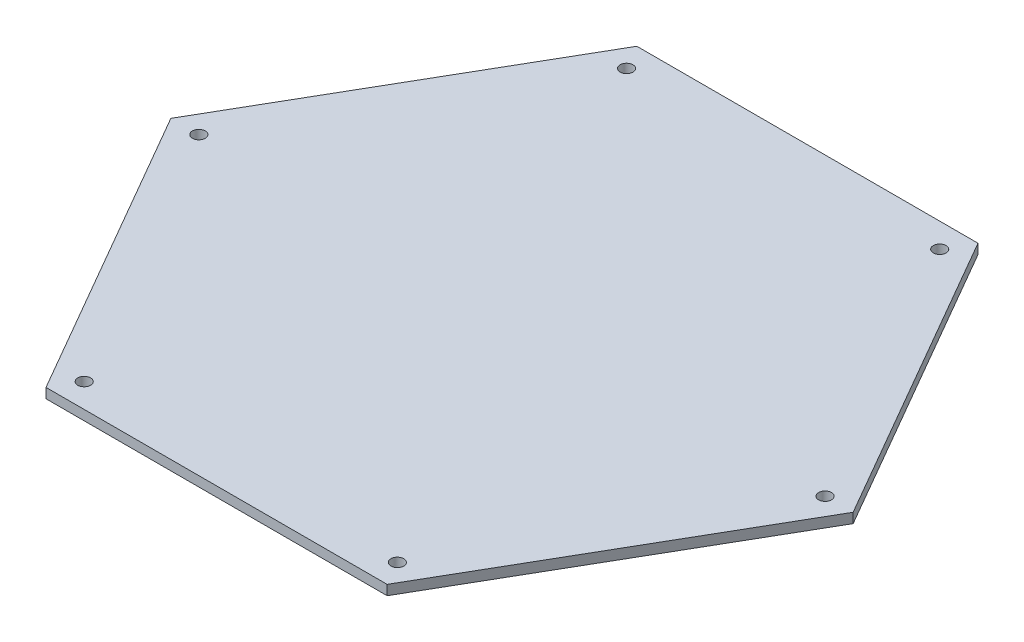
ISO-10303-21;
HEADER;
FILE_DESCRIPTION(('STEP AP214'),'2;1');
FILE_NAME('part.step','',(''),(''),'','','');
FILE_SCHEMA(('AUTOMOTIVE_DESIGN { 1 0 10303 214 1 1 1 1 }'));
ENDSEC;
DATA;
#1=APPLICATION_CONTEXT('core data for automotive mechanical design processes');
#2=APPLICATION_PROTOCOL_DEFINITION('international standard','automotive_design',2000,#1);
#3=PRODUCT_CONTEXT('',#1,'mechanical');
#4=PRODUCT('Part','Part','',(#3));
#5=PRODUCT_RELATED_PRODUCT_CATEGORY('part','',(#4));
#6=PRODUCT_DEFINITION_FORMATION('','',#4);
#7=PRODUCT_DEFINITION_CONTEXT('part definition',#1,'design');
#8=PRODUCT_DEFINITION('design','',#6,#7);
#9=PRODUCT_DEFINITION_SHAPE('','',#8);
#10=(LENGTH_UNIT() NAMED_UNIT(*) SI_UNIT(.MILLI.,.METRE.));
#11=(NAMED_UNIT(*) PLANE_ANGLE_UNIT() SI_UNIT($,.RADIAN.));
#12=(NAMED_UNIT(*) SI_UNIT($,.STERADIAN.) SOLID_ANGLE_UNIT());
#13=UNCERTAINTY_MEASURE_WITH_UNIT(LENGTH_MEASURE(1.E-05),#10,'distance_accuracy_value','');
#14=(GEOMETRIC_REPRESENTATION_CONTEXT(3) GLOBAL_UNCERTAINTY_ASSIGNED_CONTEXT((#13)) GLOBAL_UNIT_ASSIGNED_CONTEXT((#10,
#11,#12)) REPRESENTATION_CONTEXT('',''));
#15=CARTESIAN_POINT('',(0.,0.,0.));
#16=DIRECTION('',(0.,0.,1.));
#17=DIRECTION('',(1.,0.,0.));
#18=AXIS2_PLACEMENT_3D('',#15,#16,#17);
#19=CARTESIAN_POINT('',(-43.8841052859688,2.54,76.0095));
#20=DIRECTION('',(0.,0.,-1.));
#21=DIRECTION('',(-1.,0.,0.));
#22=AXIS2_PLACEMENT_3D('',#19,#20,#21);
#23=PLANE('',#22);
#24=DIRECTION('',(1.,0.,0.));
#25=VECTOR('',#24,1.);
#26=CARTESIAN_POINT('',(-43.8841052859688,0.,76.0095));
#27=LINE('',#26,#25);
#28=CARTESIAN_POINT('',(-43.8841052859688,0.,76.0095));
#29=VERTEX_POINT('',#28);
#30=CARTESIAN_POINT('',(43.8841052859688,0.,76.0095));
#31=VERTEX_POINT('',#30);
#32=EDGE_CURVE('E121',#29,#31,#27,.T.);
#33=ORIENTED_EDGE('',*,*,#32,.T.);
#34=DIRECTION('',(0.,-1.,0.));
#35=VECTOR('',#34,1.);
#36=CARTESIAN_POINT('',(43.8841052859688,2.54,76.0095));
#37=LINE('',#36,#35);
#38=CARTESIAN_POINT('',(43.8841052859688,2.54,76.0095));
#39=VERTEX_POINT('',#38);
#40=EDGE_CURVE('E11',#39,#31,#37,.T.);
#41=ORIENTED_EDGE('',*,*,#40,.F.);
#42=DIRECTION('',(1.,0.,0.));
#43=VECTOR('',#42,1.);
#44=CARTESIAN_POINT('',(-43.8841052859688,2.54,76.0095));
#45=LINE('',#44,#43);
#46=CARTESIAN_POINT('',(-43.8841052859688,2.54,76.0095));
#47=VERTEX_POINT('',#46);
#48=EDGE_CURVE('E132',#47,#39,#45,.T.);
#49=ORIENTED_EDGE('',*,*,#48,.F.);
#50=DIRECTION('',(0.,-1.,0.));
#51=VECTOR('',#50,1.);
#52=CARTESIAN_POINT('',(-43.8841052859688,2.54,76.0095));
#53=LINE('',#52,#51);
#54=EDGE_CURVE('E117',#47,#29,#53,.T.);
#55=ORIENTED_EDGE('',*,*,#54,.T.);
#56=EDGE_LOOP('',(#33,#41,#49,#55));
#57=FACE_BOUND('',#56,.T.);
#58=ADVANCED_FACE('F37',(#57),#23,.F.);
#59=CARTESIAN_POINT('',(43.8841052859688,2.54,76.0095));
#60=DIRECTION('',(-0.866025403784439,0.,-0.5));
#61=DIRECTION('',(-0.5,0.,0.866025403784439));
#62=AXIS2_PLACEMENT_3D('',#59,#60,#61);
#63=PLANE('',#62);
#64=DIRECTION('',(0.5,0.,-0.866025403784439));
#65=VECTOR('',#64,1.);
#66=CARTESIAN_POINT('',(43.8841052859688,0.,76.0095));
#67=LINE('',#66,#65);
#68=CARTESIAN_POINT('',(87.7682105719377,0.,0.));
#69=VERTEX_POINT('',#68);
#70=EDGE_CURVE('E124',#31,#69,#67,.T.);
#71=ORIENTED_EDGE('',*,*,#70,.T.);
#72=DIRECTION('',(0.,-1.,0.));
#73=VECTOR('',#72,1.);
#74=CARTESIAN_POINT('',(87.7682105719377,2.54,0.));
#75=LINE('',#74,#73);
#76=CARTESIAN_POINT('',(87.7682105719377,2.54,0.));
#77=VERTEX_POINT('',#76);
#78=EDGE_CURVE('E45',#77,#69,#75,.T.);
#79=ORIENTED_EDGE('',*,*,#78,.F.);
#80=DIRECTION('',(0.5,0.,-0.866025403784439));
#81=VECTOR('',#80,1.);
#82=CARTESIAN_POINT('',(43.8841052859688,2.54,76.0095));
#83=LINE('',#82,#81);
#84=EDGE_CURVE('E90',#39,#77,#83,.T.);
#85=ORIENTED_EDGE('',*,*,#84,.F.);
#86=ORIENTED_EDGE('',*,*,#40,.T.);
#87=EDGE_LOOP('',(#71,#79,#85,#86));
#88=FACE_BOUND('',#87,.T.);
#89=ADVANCED_FACE('F157',(#88),#63,.F.);
#90=CARTESIAN_POINT('',(87.7682105719377,2.54,0.));
#91=DIRECTION('',(-0.866025403784439,0.,0.5));
#92=DIRECTION('',(0.5,0.,0.866025403784439));
#93=AXIS2_PLACEMENT_3D('',#90,#91,#92);
#94=PLANE('',#93);
#95=DIRECTION('',(-0.5,0.,-0.866025403784439));
#96=VECTOR('',#95,1.);
#97=CARTESIAN_POINT('',(87.7682105719377,0.,0.));
#98=LINE('',#97,#96);
#99=CARTESIAN_POINT('',(43.8841052859689,0.,-76.0095));
#100=VERTEX_POINT('',#99);
#101=EDGE_CURVE('E127',#69,#100,#98,.T.);
#102=ORIENTED_EDGE('',*,*,#101,.T.);
#103=DIRECTION('',(0.,-1.,0.));
#104=VECTOR('',#103,1.);
#105=CARTESIAN_POINT('',(43.8841052859689,2.54,-76.0095));
#106=LINE('',#105,#104);
#107=CARTESIAN_POINT('',(43.8841052859689,2.54,-76.0095));
#108=VERTEX_POINT('',#107);
#109=EDGE_CURVE('E112',#108,#100,#106,.T.);
#110=ORIENTED_EDGE('',*,*,#109,.F.);
#111=DIRECTION('',(-0.5,0.,-0.866025403784439));
#112=VECTOR('',#111,1.);
#113=CARTESIAN_POINT('',(87.7682105719377,2.54,0.));
#114=LINE('',#113,#112);
#115=EDGE_CURVE('E103',#77,#108,#114,.T.);
#116=ORIENTED_EDGE('',*,*,#115,.F.);
#117=ORIENTED_EDGE('',*,*,#78,.T.);
#118=EDGE_LOOP('',(#102,#110,#116,#117));
#119=FACE_BOUND('',#118,.T.);
#120=ADVANCED_FACE('F138',(#119),#94,.F.);
#121=CARTESIAN_POINT('',(43.8841052859689,2.54,-76.0095));
#122=DIRECTION('',(0.,0.,1.));
#123=DIRECTION('',(1.,0.,0.));
#124=AXIS2_PLACEMENT_3D('',#121,#122,#123);
#125=PLANE('',#124);
#126=DIRECTION('',(-1.,0.,0.));
#127=VECTOR('',#126,1.);
#128=CARTESIAN_POINT('',(43.8841052859689,0.,-76.0095));
#129=LINE('',#128,#127);
#130=CARTESIAN_POINT('',(-43.8841052859688,0.,-76.0095));
#131=VERTEX_POINT('',#130);
#132=EDGE_CURVE('E111',#100,#131,#129,.T.);
#133=ORIENTED_EDGE('',*,*,#132,.T.);
#134=DIRECTION('',(0.,-1.,0.));
#135=VECTOR('',#134,1.);
#136=CARTESIAN_POINT('',(-43.8841052859688,2.54,-76.0095));
#137=LINE('',#136,#135);
#138=CARTESIAN_POINT('',(-43.8841052859688,2.54,-76.0095));
#139=VERTEX_POINT('',#138);
#140=EDGE_CURVE('E108',#139,#131,#137,.T.);
#141=ORIENTED_EDGE('',*,*,#140,.F.);
#142=DIRECTION('',(-1.,0.,0.));
#143=VECTOR('',#142,1.);
#144=CARTESIAN_POINT('',(43.8841052859689,2.54,-76.0095));
#145=LINE('',#144,#143);
#146=EDGE_CURVE('E97',#108,#139,#145,.T.);
#147=ORIENTED_EDGE('',*,*,#146,.F.);
#148=ORIENTED_EDGE('',*,*,#109,.T.);
#149=EDGE_LOOP('',(#133,#141,#147,#148));
#150=FACE_BOUND('',#149,.T.);
#151=ADVANCED_FACE('F109',(#150),#125,.F.);
#152=CARTESIAN_POINT('',(-43.8841052859688,2.54,-76.0095));
#153=DIRECTION('',(0.866025403784439,0.,0.5));
#154=DIRECTION('',(0.5,0.,-0.866025403784439));
#155=AXIS2_PLACEMENT_3D('',#152,#153,#154);
#156=PLANE('',#155);
#157=DIRECTION('',(-0.5,0.,0.866025403784439));
#158=VECTOR('',#157,1.);
#159=CARTESIAN_POINT('',(-43.8841052859688,0.,-76.0095));
#160=LINE('',#159,#158);
#161=CARTESIAN_POINT('',(-87.7682105719377,0.,0.));
#162=VERTEX_POINT('',#161);
#163=EDGE_CURVE('E76',#131,#162,#160,.T.);
#164=ORIENTED_EDGE('',*,*,#163,.T.);
#165=DIRECTION('',(0.,-1.,0.));
#166=VECTOR('',#165,1.);
#167=CARTESIAN_POINT('',(-87.7682105719377,2.54,0.));
#168=LINE('',#167,#166);
#169=CARTESIAN_POINT('',(-87.7682105719377,2.54,0.));
#170=VERTEX_POINT('',#169);
#171=EDGE_CURVE('E113',#170,#162,#168,.T.);
#172=ORIENTED_EDGE('',*,*,#171,.F.);
#173=DIRECTION('',(-0.5,0.,0.866025403784439));
#174=VECTOR('',#173,1.);
#175=CARTESIAN_POINT('',(-43.8841052859688,2.54,-76.0095));
#176=LINE('',#175,#174);
#177=EDGE_CURVE('E101',#139,#170,#176,.T.);
#178=ORIENTED_EDGE('',*,*,#177,.F.);
#179=ORIENTED_EDGE('',*,*,#140,.T.);
#180=EDGE_LOOP('',(#164,#172,#178,#179));
#181=FACE_BOUND('',#180,.T.);
#182=ADVANCED_FACE('F115',(#181),#156,.F.);
#183=CARTESIAN_POINT('',(-87.7682105719377,2.54,0.));
#184=DIRECTION('',(0.866025403784439,0.,-0.5));
#185=DIRECTION('',(-0.5,0.,-0.866025403784439));
#186=AXIS2_PLACEMENT_3D('',#183,#184,#185);
#187=PLANE('',#186);
#188=DIRECTION('',(0.5,0.,0.866025403784439));
#189=VECTOR('',#188,1.);
#190=CARTESIAN_POINT('',(-87.7682105719377,0.,0.));
#191=LINE('',#190,#189);
#192=EDGE_CURVE('E82',#162,#29,#191,.T.);
#193=ORIENTED_EDGE('',*,*,#192,.T.);
#194=ORIENTED_EDGE('',*,*,#54,.F.);
#195=DIRECTION('',(0.5,0.,0.866025403784439));
#196=VECTOR('',#195,1.);
#197=CARTESIAN_POINT('',(-87.7682105719377,2.54,0.));
#198=LINE('',#197,#196);
#199=EDGE_CURVE('E53',#170,#47,#198,.T.);
#200=ORIENTED_EDGE('',*,*,#199,.F.);
#201=ORIENTED_EDGE('',*,*,#171,.T.);
#202=EDGE_LOOP('',(#193,#194,#200,#201));
#203=FACE_BOUND('',#202,.T.);
#204=ADVANCED_FACE('F145',(#203),#187,.F.);
#205=CARTESIAN_POINT('',(0.,2.54,0.));
#206=DIRECTION('',(0.,1.,0.));
#207=DIRECTION('',(0.,0.,1.));
#208=AXIS2_PLACEMENT_3D('',#205,#206,#207);
#209=PLANE('',#208);
#210=CARTESIAN_POINT('',(-80.5464461936925,2.54,0.0298529725795453));
#211=DIRECTION('',(0.,1.,0.));
#212=DIRECTION('',(0.86602540378444,0.,0.499999999999998));
#213=AXIS2_PLACEMENT_3D('',#210,#211,#212);
#214=CIRCLE('',#213,1.651);
#215=CARTESIAN_POINT('',(-79.1166382520444,2.54,0.855352972579541));
#216=VERTEX_POINT('',#215);
#217=EDGE_CURVE('E305',#216,#216,#214,.T.);
#218=ORIENTED_EDGE('',*,*,#217,.F.);
#219=EDGE_LOOP('',(#218));
#220=FACE_BOUND('',#219,.T.);
#221=CARTESIAN_POINT('',(-40.2646052859685,2.54,69.8000480471634));
#222=DIRECTION('',(0.,1.,0.));
#223=DIRECTION('',(0.866025403784436,0.,-0.500000000000004));
#224=AXIS2_PLACEMENT_3D('',#221,#222,#223);
#225=CIRCLE('',#224,1.651);
#226=CARTESIAN_POINT('',(-38.8347973443204,2.54,68.9745480471634));
#227=VERTEX_POINT('',#226);
#228=EDGE_CURVE('E311',#227,#227,#225,.T.);
#229=ORIENTED_EDGE('',*,*,#228,.F.);
#230=EDGE_LOOP('',(#229));
#231=FACE_BOUND('',#230,.T.);
#232=CARTESIAN_POINT('',(40.2990765294785,2.54,69.8000480471631));
#233=DIRECTION('',(0.,1.,0.));
#234=DIRECTION('',(0.,0.,-1.));
#235=AXIS2_PLACEMENT_3D('',#232,#233,#234);
#236=CIRCLE('',#235,1.651);
#237=CARTESIAN_POINT('',(40.2990765294785,2.54,68.1490480471631));
#238=VERTEX_POINT('',#237);
#239=EDGE_CURVE('E319',#238,#238,#236,.T.);
#240=ORIENTED_EDGE('',*,*,#239,.F.);
#241=EDGE_LOOP('',(#240));
#242=FACE_BOUND('',#241,.T.);
#243=CARTESIAN_POINT('',(80.5809174372021,2.54,0.0298529725785979));
#244=DIRECTION('',(0.,1.,0.));
#245=DIRECTION('',(-0.866025403784443,0.,-0.499999999999992));
#246=AXIS2_PLACEMENT_3D('',#243,#244,#245);
#247=CIRCLE('',#246,1.651);
#248=CARTESIAN_POINT('',(79.151109495554,2.54,-0.795647027421388));
#249=VERTEX_POINT('',#248);
#250=EDGE_CURVE('E325',#249,#249,#247,.T.);
#251=ORIENTED_EDGE('',*,*,#250,.F.);
#252=EDGE_LOOP('',(#251));
#253=FACE_BOUND('',#252,.T.);
#254=CARTESIAN_POINT('',(40.2990765294777,2.54,-69.7403421020049));
#255=DIRECTION('',(0.,1.,0.));
#256=DIRECTION('',(-0.866025403784433,0.,0.50000000000001));
#257=AXIS2_PLACEMENT_3D('',#254,#255,#256);
#258=CIRCLE('',#257,1.651);
#259=CARTESIAN_POINT('',(38.8692685878296,2.54,-68.9148421020049));
#260=VERTEX_POINT('',#259);
#261=EDGE_CURVE('E331',#260,#260,#258,.T.);
#262=ORIENTED_EDGE('',*,*,#261,.F.);
#263=EDGE_LOOP('',(#262));
#264=FACE_BOUND('',#263,.T.);
#265=CARTESIAN_POINT('',(-40.2646052859688,2.54,-69.7403421020044));
#266=DIRECTION('',(0.,1.,0.));
#267=DIRECTION('',(0.,0.,1.));
#268=AXIS2_PLACEMENT_3D('',#265,#266,#267);
#269=CIRCLE('',#268,1.651);
#270=CARTESIAN_POINT('',(-40.2646052859688,2.54,-68.0893421020044));
#271=VERTEX_POINT('',#270);
#272=EDGE_CURVE('E308',#271,#271,#269,.T.);
#273=ORIENTED_EDGE('',*,*,#272,.F.);
#274=EDGE_LOOP('',(#273));
#275=FACE_BOUND('',#274,.T.);
#276=ORIENTED_EDGE('',*,*,#48,.T.);
#277=ORIENTED_EDGE('',*,*,#84,.T.);
#278=ORIENTED_EDGE('',*,*,#115,.T.);
#279=ORIENTED_EDGE('',*,*,#146,.T.);
#280=ORIENTED_EDGE('',*,*,#177,.T.);
#281=ORIENTED_EDGE('',*,*,#199,.T.);
#282=EDGE_LOOP('',(#276,#277,#278,#279,#280,#281));
#283=FACE_BOUND('',#282,.T.);
#284=ADVANCED_FACE('F99',(#220,#231,#242,#253,#264,#275,#283),#209,.T.);
#285=CARTESIAN_POINT('',(0.,0.,0.));
#286=DIRECTION('',(0.,1.,0.));
#287=DIRECTION('',(0.,0.,1.));
#288=AXIS2_PLACEMENT_3D('',#285,#286,#287);
#289=PLANE('',#288);
#290=CARTESIAN_POINT('',(-80.5464461936925,0.,0.0298529725795453));
#291=DIRECTION('',(0.,1.,0.));
#292=DIRECTION('',(0.86602540378444,0.,0.499999999999998));
#293=AXIS2_PLACEMENT_3D('',#290,#291,#292);
#294=CIRCLE('',#293,1.651);
#295=CARTESIAN_POINT('',(-79.1166382520444,0.,0.855352972579541));
#296=VERTEX_POINT('',#295);
#297=EDGE_CURVE('E302',#296,#296,#294,.T.);
#298=ORIENTED_EDGE('',*,*,#297,.T.);
#299=EDGE_LOOP('',(#298));
#300=FACE_BOUND('',#299,.T.);
#301=CARTESIAN_POINT('',(-40.2646052859685,0.,69.8000480471634));
#302=DIRECTION('',(0.,1.,0.));
#303=DIRECTION('',(0.866025403784436,0.,-0.500000000000004));
#304=AXIS2_PLACEMENT_3D('',#301,#302,#303);
#305=CIRCLE('',#304,1.651);
#306=CARTESIAN_POINT('',(-38.8347973443204,0.,68.9745480471634));
#307=VERTEX_POINT('',#306);
#308=EDGE_CURVE('E306',#307,#307,#305,.T.);
#309=ORIENTED_EDGE('',*,*,#308,.T.);
#310=EDGE_LOOP('',(#309));
#311=FACE_BOUND('',#310,.T.);
#312=CARTESIAN_POINT('',(40.2990765294785,0.,69.8000480471631));
#313=DIRECTION('',(0.,1.,0.));
#314=DIRECTION('',(0.,0.,-1.));
#315=AXIS2_PLACEMENT_3D('',#312,#313,#314);
#316=CIRCLE('',#315,1.651);
#317=CARTESIAN_POINT('',(40.2990765294785,0.,68.1490480471631));
#318=VERTEX_POINT('',#317);
#319=EDGE_CURVE('E316',#318,#318,#316,.T.);
#320=ORIENTED_EDGE('',*,*,#319,.T.);
#321=EDGE_LOOP('',(#320));
#322=FACE_BOUND('',#321,.T.);
#323=CARTESIAN_POINT('',(80.5809174372021,0.,0.0298529725785979));
#324=DIRECTION('',(0.,1.,0.));
#325=DIRECTION('',(-0.866025403784443,0.,-0.499999999999992));
#326=AXIS2_PLACEMENT_3D('',#323,#324,#325);
#327=CIRCLE('',#326,1.651);
#328=CARTESIAN_POINT('',(79.151109495554,0.,-0.795647027421388));
#329=VERTEX_POINT('',#328);
#330=EDGE_CURVE('E322',#329,#329,#327,.T.);
#331=ORIENTED_EDGE('',*,*,#330,.T.);
#332=EDGE_LOOP('',(#331));
#333=FACE_BOUND('',#332,.T.);
#334=CARTESIAN_POINT('',(40.2990765294777,0.,-69.7403421020049));
#335=DIRECTION('',(0.,1.,0.));
#336=DIRECTION('',(-0.866025403784433,0.,0.50000000000001));
#337=AXIS2_PLACEMENT_3D('',#334,#335,#336);
#338=CIRCLE('',#337,1.651);
#339=CARTESIAN_POINT('',(38.8692685878296,0.,-68.9148421020049));
#340=VERTEX_POINT('',#339);
#341=EDGE_CURVE('E328',#340,#340,#338,.T.);
#342=ORIENTED_EDGE('',*,*,#341,.T.);
#343=EDGE_LOOP('',(#342));
#344=FACE_BOUND('',#343,.T.);
#345=CARTESIAN_POINT('',(-40.2646052859688,0.,-69.7403421020044));
#346=DIRECTION('',(0.,1.,0.));
#347=DIRECTION('',(0.,0.,1.));
#348=AXIS2_PLACEMENT_3D('',#345,#346,#347);
#349=CIRCLE('',#348,1.651);
#350=CARTESIAN_POINT('',(-40.2646052859688,0.,-68.0893421020044));
#351=VERTEX_POINT('',#350);
#352=EDGE_CURVE('E125',#351,#351,#349,.T.);
#353=ORIENTED_EDGE('',*,*,#352,.T.);
#354=EDGE_LOOP('',(#353));
#355=FACE_BOUND('',#354,.T.);
#356=ORIENTED_EDGE('',*,*,#32,.F.);
#357=ORIENTED_EDGE('',*,*,#192,.F.);
#358=ORIENTED_EDGE('',*,*,#163,.F.);
#359=ORIENTED_EDGE('',*,*,#132,.F.);
#360=ORIENTED_EDGE('',*,*,#101,.F.);
#361=ORIENTED_EDGE('',*,*,#70,.F.);
#362=EDGE_LOOP('',(#356,#357,#358,#359,#360,#361));
#363=FACE_BOUND('',#362,.T.);
#364=ADVANCED_FACE('F141',(#300,#311,#322,#333,#344,#355,#363),#289,.F.);
#365=CARTESIAN_POINT('',(-40.2646052859688,0.,-69.7403421020044));
#366=DIRECTION('',(0.,1.,0.));
#367=DIRECTION('',(0.,0.,1.));
#368=AXIS2_PLACEMENT_3D('',#365,#366,#367);
#369=CYLINDRICAL_SURFACE('',#368,1.651);
#370=ORIENTED_EDGE('',*,*,#352,.F.);
#371=EDGE_LOOP('',(#370));
#372=FACE_BOUND('',#371,.T.);
#373=ORIENTED_EDGE('',*,*,#272,.T.);
#374=EDGE_LOOP('',(#373));
#375=FACE_BOUND('',#374,.T.);
#376=ADVANCED_FACE('F187',(#372,#375),#369,.F.);
#377=CARTESIAN_POINT('',(40.2990765294777,0.,-69.7403421020049));
#378=DIRECTION('',(0.,1.,0.));
#379=DIRECTION('',(0.,0.,1.));
#380=AXIS2_PLACEMENT_3D('',#377,#378,#379);
#381=CYLINDRICAL_SURFACE('',#380,1.651);
#382=ORIENTED_EDGE('',*,*,#341,.F.);
#383=EDGE_LOOP('',(#382));
#384=FACE_BOUND('',#383,.T.);
#385=ORIENTED_EDGE('',*,*,#261,.T.);
#386=EDGE_LOOP('',(#385));
#387=FACE_BOUND('',#386,.T.);
#388=ADVANCED_FACE('F192',(#384,#387),#381,.F.);
#389=CARTESIAN_POINT('',(80.5809174372021,0.,0.0298529725785979));
#390=DIRECTION('',(0.,1.,0.));
#391=DIRECTION('',(0.,0.,1.));
#392=AXIS2_PLACEMENT_3D('',#389,#390,#391);
#393=CYLINDRICAL_SURFACE('',#392,1.651);
#394=ORIENTED_EDGE('',*,*,#330,.F.);
#395=EDGE_LOOP('',(#394));
#396=FACE_BOUND('',#395,.T.);
#397=ORIENTED_EDGE('',*,*,#250,.T.);
#398=EDGE_LOOP('',(#397));
#399=FACE_BOUND('',#398,.T.);
#400=ADVANCED_FACE('F218',(#396,#399),#393,.F.);
#401=CARTESIAN_POINT('',(40.2990765294785,0.,69.8000480471631));
#402=DIRECTION('',(0.,1.,0.));
#403=DIRECTION('',(0.,0.,1.));
#404=AXIS2_PLACEMENT_3D('',#401,#402,#403);
#405=CYLINDRICAL_SURFACE('',#404,1.651);
#406=ORIENTED_EDGE('',*,*,#319,.F.);
#407=EDGE_LOOP('',(#406));
#408=FACE_BOUND('',#407,.T.);
#409=ORIENTED_EDGE('',*,*,#239,.T.);
#410=EDGE_LOOP('',(#409));
#411=FACE_BOUND('',#410,.T.);
#412=ADVANCED_FACE('F229',(#408,#411),#405,.F.);
#413=CARTESIAN_POINT('',(-40.2646052859685,0.,69.8000480471634));
#414=DIRECTION('',(0.,1.,0.));
#415=DIRECTION('',(0.,0.,1.));
#416=AXIS2_PLACEMENT_3D('',#413,#414,#415);
#417=CYLINDRICAL_SURFACE('',#416,1.651);
#418=ORIENTED_EDGE('',*,*,#308,.F.);
#419=EDGE_LOOP('',(#418));
#420=FACE_BOUND('',#419,.T.);
#421=ORIENTED_EDGE('',*,*,#228,.T.);
#422=EDGE_LOOP('',(#421));
#423=FACE_BOUND('',#422,.T.);
#424=ADVANCED_FACE('F240',(#420,#423),#417,.F.);
#425=CARTESIAN_POINT('',(-80.5464461936925,0.,0.0298529725795453));
#426=DIRECTION('',(0.,1.,0.));
#427=DIRECTION('',(0.,0.,1.));
#428=AXIS2_PLACEMENT_3D('',#425,#426,#427);
#429=CYLINDRICAL_SURFACE('',#428,1.651);
#430=ORIENTED_EDGE('',*,*,#297,.F.);
#431=EDGE_LOOP('',(#430));
#432=FACE_BOUND('',#431,.T.);
#433=ORIENTED_EDGE('',*,*,#217,.T.);
#434=EDGE_LOOP('',(#433));
#435=FACE_BOUND('',#434,.T.);
#436=ADVANCED_FACE('F251',(#432,#435),#429,.F.);
#437=CLOSED_SHELL('',(#58,#89,#120,#151,#182,#204,#284,#364,#376,#388,#400,#412,#424,#436));
#438=MANIFOLD_SOLID_BREP('B2',#437);
#439=ADVANCED_BREP_SHAPE_REPRESENTATION('',(#18,#438),#14);
#440=SHAPE_DEFINITION_REPRESENTATION(#9,#439);
ENDSEC;
END-ISO-10303-21;
